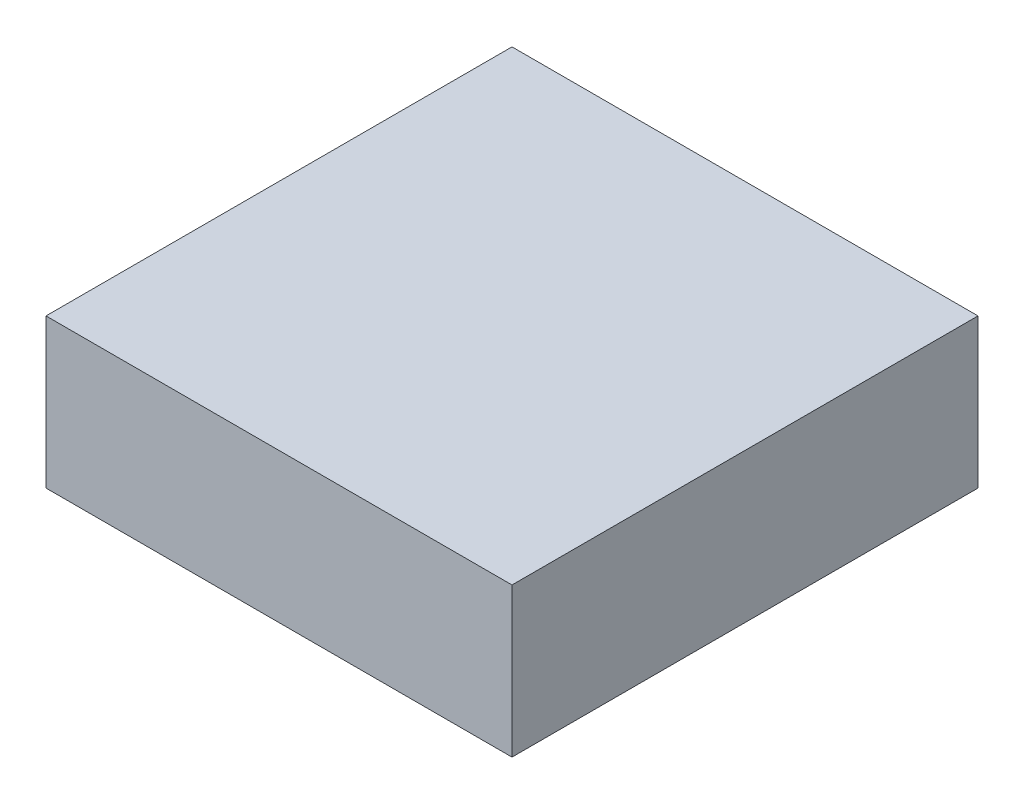
ISO-10303-21;
HEADER;
FILE_DESCRIPTION(('STEP AP214'),'2;1');
FILE_NAME('part.step','',(''),(''),'','','');
FILE_SCHEMA(('AUTOMOTIVE_DESIGN { 1 0 10303 214 1 1 1 1 }'));
ENDSEC;
DATA;
#1=APPLICATION_CONTEXT('core data for automotive mechanical design processes');
#2=APPLICATION_PROTOCOL_DEFINITION('international standard','automotive_design',2000,#1);
#3=PRODUCT_CONTEXT('',#1,'mechanical');
#4=PRODUCT('Part','Part','',(#3));
#5=PRODUCT_RELATED_PRODUCT_CATEGORY('part','',(#4));
#6=PRODUCT_DEFINITION_FORMATION('','',#4);
#7=PRODUCT_DEFINITION_CONTEXT('part definition',#1,'design');
#8=PRODUCT_DEFINITION('design','',#6,#7);
#9=PRODUCT_DEFINITION_SHAPE('','',#8);
#10=(LENGTH_UNIT() NAMED_UNIT(*) SI_UNIT(.MILLI.,.METRE.));
#11=(NAMED_UNIT(*) PLANE_ANGLE_UNIT() SI_UNIT($,.RADIAN.));
#12=(NAMED_UNIT(*) SI_UNIT($,.STERADIAN.) SOLID_ANGLE_UNIT());
#13=UNCERTAINTY_MEASURE_WITH_UNIT(LENGTH_MEASURE(1.E-05),#10,'distance_accuracy_value','');
#14=(GEOMETRIC_REPRESENTATION_CONTEXT(3) GLOBAL_UNCERTAINTY_ASSIGNED_CONTEXT((#13)) GLOBAL_UNIT_ASSIGNED_CONTEXT((#10,
#11,#12)) REPRESENTATION_CONTEXT('',''));
#15=CARTESIAN_POINT('',(0.,0.,0.));
#16=DIRECTION('',(0.,0.,1.));
#17=DIRECTION('',(1.,0.,0.));
#18=AXIS2_PLACEMENT_3D('',#15,#16,#17);
#19=CARTESIAN_POINT('',(1.25,0.8,-1.25));
#20=DIRECTION('',(-1.,0.,0.));
#21=DIRECTION('',(0.,0.,1.));
#22=AXIS2_PLACEMENT_3D('',#19,#20,#21);
#23=PLANE('',#22);
#24=DIRECTION('',(0.,0.,-1.));
#25=VECTOR('',#24,1.);
#26=CARTESIAN_POINT('',(1.25,0.,-1.25));
#27=LINE('',#26,#25);
#28=CARTESIAN_POINT('',(1.25,0.,1.25));
#29=VERTEX_POINT('',#28);
#30=CARTESIAN_POINT('',(1.25,0.,-1.25));
#31=VERTEX_POINT('',#30);
#32=EDGE_CURVE('E97',#29,#31,#27,.T.);
#33=ORIENTED_EDGE('',*,*,#32,.T.);
#34=DIRECTION('',(0.,-1.,0.));
#35=VECTOR('',#34,1.);
#36=CARTESIAN_POINT('',(1.25,0.8,-1.25));
#37=LINE('',#36,#35);
#38=CARTESIAN_POINT('',(1.25,0.8,-1.25));
#39=VERTEX_POINT('',#38);
#40=EDGE_CURVE('E11',#39,#31,#37,.T.);
#41=ORIENTED_EDGE('',*,*,#40,.F.);
#42=DIRECTION('',(0.,0.,-1.));
#43=VECTOR('',#42,1.);
#44=CARTESIAN_POINT('',(1.25,0.8,-1.25));
#45=LINE('',#44,#43);
#46=CARTESIAN_POINT('',(1.25,0.8,1.25));
#47=VERTEX_POINT('',#46);
#48=EDGE_CURVE('E85',#47,#39,#45,.T.);
#49=ORIENTED_EDGE('',*,*,#48,.F.);
#50=DIRECTION('',(0.,-1.,0.));
#51=VECTOR('',#50,1.);
#52=CARTESIAN_POINT('',(1.25,0.8,1.25));
#53=LINE('',#52,#51);
#54=EDGE_CURVE('E93',#47,#29,#53,.T.);
#55=ORIENTED_EDGE('',*,*,#54,.T.);
#56=EDGE_LOOP('',(#33,#41,#49,#55));
#57=FACE_BOUND('',#56,.T.);
#58=ADVANCED_FACE('F34',(#57),#23,.F.);
#59=CARTESIAN_POINT('',(-1.25,0.8,-1.25));
#60=DIRECTION('',(0.,0.,1.));
#61=DIRECTION('',(1.,0.,0.));
#62=AXIS2_PLACEMENT_3D('',#59,#60,#61);
#63=PLANE('',#62);
#64=DIRECTION('',(-1.,0.,0.));
#65=VECTOR('',#64,1.);
#66=CARTESIAN_POINT('',(-1.25,0.,-1.25));
#67=LINE('',#66,#65);
#68=CARTESIAN_POINT('',(-1.25,0.,-1.25));
#69=VERTEX_POINT('',#68);
#70=EDGE_CURVE('E89',#31,#69,#67,.T.);
#71=ORIENTED_EDGE('',*,*,#70,.T.);
#72=DIRECTION('',(0.,-1.,0.));
#73=VECTOR('',#72,1.);
#74=CARTESIAN_POINT('',(-1.25,0.8,-1.25));
#75=LINE('',#74,#73);
#76=CARTESIAN_POINT('',(-1.25,0.8,-1.25));
#77=VERTEX_POINT('',#76);
#78=EDGE_CURVE('E42',#77,#69,#75,.T.);
#79=ORIENTED_EDGE('',*,*,#78,.F.);
#80=DIRECTION('',(-1.,0.,0.));
#81=VECTOR('',#80,1.);
#82=CARTESIAN_POINT('',(-1.25,0.8,-1.25));
#83=LINE('',#82,#81);
#84=EDGE_CURVE('E80',#39,#77,#83,.T.);
#85=ORIENTED_EDGE('',*,*,#84,.F.);
#86=ORIENTED_EDGE('',*,*,#40,.T.);
#87=EDGE_LOOP('',(#71,#79,#85,#86));
#88=FACE_BOUND('',#87,.T.);
#89=ADVANCED_FACE('F88',(#88),#63,.F.);
#90=CARTESIAN_POINT('',(-1.25,0.8,-1.25));
#91=DIRECTION('',(1.,0.,0.));
#92=DIRECTION('',(0.,0.,-1.));
#93=AXIS2_PLACEMENT_3D('',#90,#91,#92);
#94=PLANE('',#93);
#95=DIRECTION('',(0.,0.,1.));
#96=VECTOR('',#95,1.);
#97=CARTESIAN_POINT('',(-1.25,0.,-1.25));
#98=LINE('',#97,#96);
#99=CARTESIAN_POINT('',(-1.25,0.,1.25));
#100=VERTEX_POINT('',#99);
#101=EDGE_CURVE('E67',#69,#100,#98,.T.);
#102=ORIENTED_EDGE('',*,*,#101,.T.);
#103=DIRECTION('',(0.,-1.,0.));
#104=VECTOR('',#103,1.);
#105=CARTESIAN_POINT('',(-1.25,0.8,1.25));
#106=LINE('',#105,#104);
#107=CARTESIAN_POINT('',(-1.25,0.8,1.25));
#108=VERTEX_POINT('',#107);
#109=EDGE_CURVE('E90',#108,#100,#106,.T.);
#110=ORIENTED_EDGE('',*,*,#109,.F.);
#111=DIRECTION('',(0.,0.,1.));
#112=VECTOR('',#111,1.);
#113=CARTESIAN_POINT('',(-1.25,0.8,-1.25));
#114=LINE('',#113,#112);
#115=EDGE_CURVE('E83',#77,#108,#114,.T.);
#116=ORIENTED_EDGE('',*,*,#115,.F.);
#117=ORIENTED_EDGE('',*,*,#78,.T.);
#118=EDGE_LOOP('',(#102,#110,#116,#117));
#119=FACE_BOUND('',#118,.T.);
#120=ADVANCED_FACE('F91',(#119),#94,.F.);
#121=CARTESIAN_POINT('',(-1.25,0.8,1.25));
#122=DIRECTION('',(0.,0.,-1.));
#123=DIRECTION('',(-1.,0.,0.));
#124=AXIS2_PLACEMENT_3D('',#121,#122,#123);
#125=PLANE('',#124);
#126=DIRECTION('',(1.,0.,0.));
#127=VECTOR('',#126,1.);
#128=CARTESIAN_POINT('',(-1.25,0.,1.25));
#129=LINE('',#128,#127);
#130=EDGE_CURVE('E73',#100,#29,#129,.T.);
#131=ORIENTED_EDGE('',*,*,#130,.T.);
#132=ORIENTED_EDGE('',*,*,#54,.F.);
#133=DIRECTION('',(1.,0.,0.));
#134=VECTOR('',#133,1.);
#135=CARTESIAN_POINT('',(-1.25,0.8,1.25));
#136=LINE('',#135,#134);
#137=EDGE_CURVE('E50',#108,#47,#136,.T.);
#138=ORIENTED_EDGE('',*,*,#137,.F.);
#139=ORIENTED_EDGE('',*,*,#109,.T.);
#140=EDGE_LOOP('',(#131,#132,#138,#139));
#141=FACE_BOUND('',#140,.T.);
#142=ADVANCED_FACE('F104',(#141),#125,.F.);
#143=CARTESIAN_POINT('',(0.,0.8,0.));
#144=DIRECTION('',(0.,1.,0.));
#145=DIRECTION('',(0.,0.,1.));
#146=AXIS2_PLACEMENT_3D('',#143,#144,#145);
#147=PLANE('',#146);
#148=ORIENTED_EDGE('',*,*,#48,.T.);
#149=ORIENTED_EDGE('',*,*,#84,.T.);
#150=ORIENTED_EDGE('',*,*,#115,.T.);
#151=ORIENTED_EDGE('',*,*,#137,.T.);
#152=EDGE_LOOP('',(#148,#149,#150,#151));
#153=FACE_BOUND('',#152,.T.);
#154=ADVANCED_FACE('F81',(#153),#147,.T.);
#155=CARTESIAN_POINT('',(0.,0.,0.));
#156=DIRECTION('',(0.,1.,0.));
#157=DIRECTION('',(0.,0.,1.));
#158=AXIS2_PLACEMENT_3D('',#155,#156,#157);
#159=PLANE('',#158);
#160=ORIENTED_EDGE('',*,*,#32,.F.);
#161=ORIENTED_EDGE('',*,*,#130,.F.);
#162=ORIENTED_EDGE('',*,*,#101,.F.);
#163=ORIENTED_EDGE('',*,*,#70,.F.);
#164=EDGE_LOOP('',(#160,#161,#162,#163));
#165=FACE_BOUND('',#164,.T.);
#166=ADVANCED_FACE('F107',(#165),#159,.F.);
#167=CLOSED_SHELL('',(#58,#89,#120,#142,#154,#166));
#168=MANIFOLD_SOLID_BREP('B2',#167);
#169=ADVANCED_BREP_SHAPE_REPRESENTATION('',(#18,#168),#14);
#170=SHAPE_DEFINITION_REPRESENTATION(#9,#169);
ENDSEC;
END-ISO-10303-21;
